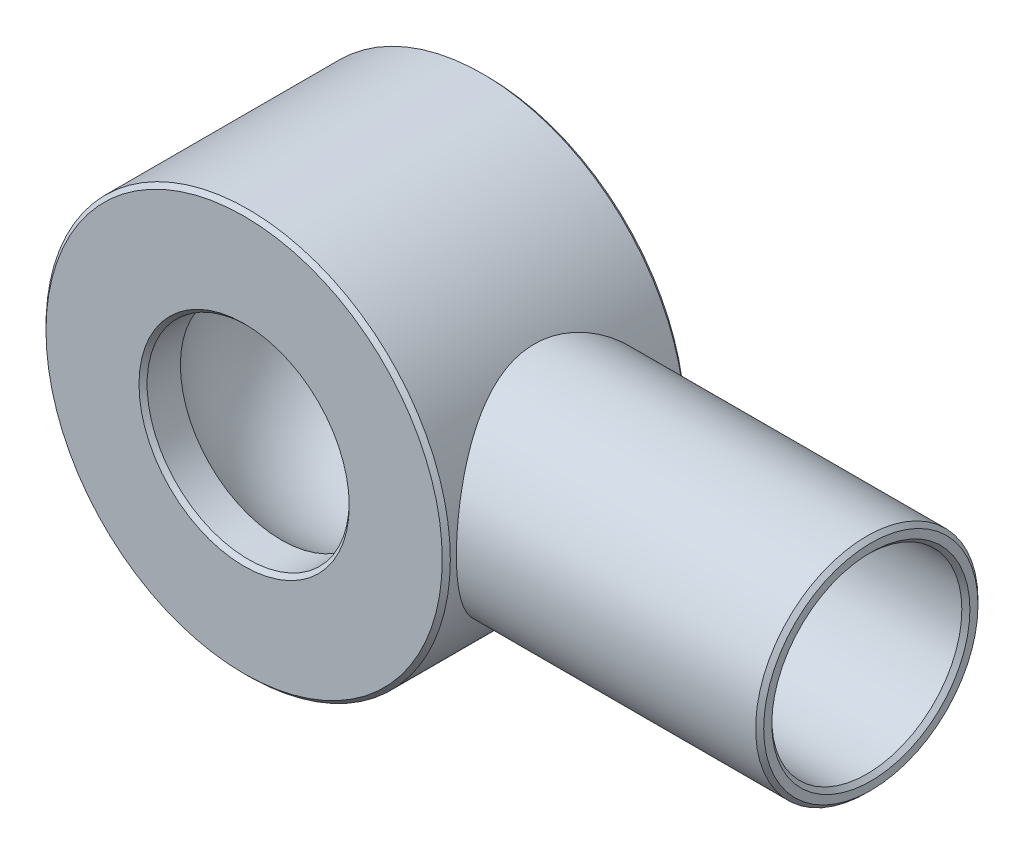
ISO-10303-21;
HEADER;
FILE_DESCRIPTION(('STEP AP214'),'2;1');
FILE_NAME('part.step','',(''),(''),'','','');
FILE_SCHEMA(('AUTOMOTIVE_DESIGN { 1 0 10303 214 1 1 1 1 }'));
ENDSEC;
DATA;
#1=APPLICATION_CONTEXT('core data for automotive mechanical design processes');
#2=APPLICATION_PROTOCOL_DEFINITION('international standard','automotive_design',2000,#1);
#3=PRODUCT_CONTEXT('',#1,'mechanical');
#4=PRODUCT('Part','Part','',(#3));
#5=PRODUCT_RELATED_PRODUCT_CATEGORY('part','',(#4));
#6=PRODUCT_DEFINITION_FORMATION('','',#4);
#7=PRODUCT_DEFINITION_CONTEXT('part definition',#1,'design');
#8=PRODUCT_DEFINITION('design','',#6,#7);
#9=PRODUCT_DEFINITION_SHAPE('','',#8);
#10=(LENGTH_UNIT() NAMED_UNIT(*) SI_UNIT(.MILLI.,.METRE.));
#11=(NAMED_UNIT(*) PLANE_ANGLE_UNIT() SI_UNIT($,.RADIAN.));
#12=(NAMED_UNIT(*) SI_UNIT($,.STERADIAN.) SOLID_ANGLE_UNIT());
#13=UNCERTAINTY_MEASURE_WITH_UNIT(LENGTH_MEASURE(1.E-05),#10,'distance_accuracy_value','');
#14=(GEOMETRIC_REPRESENTATION_CONTEXT(3) GLOBAL_UNCERTAINTY_ASSIGNED_CONTEXT((#13)) GLOBAL_UNIT_ASSIGNED_CONTEXT((#10,
#11,#12)) REPRESENTATION_CONTEXT('',''));
#15=CARTESIAN_POINT('',(0.,0.,0.));
#16=DIRECTION('',(0.,0.,1.));
#17=DIRECTION('',(1.,0.,0.));
#18=AXIS2_PLACEMENT_3D('',#15,#16,#17);
#19=CARTESIAN_POINT('',(0.,0.,-30.));
#20=DIRECTION('',(0.,0.,1.));
#21=DIRECTION('',(1.,0.,0.));
#22=AXIS2_PLACEMENT_3D('',#19,#20,#21);
#23=CYLINDRICAL_SURFACE('',#22,25.);
#24=CARTESIAN_POINT('',(0.,0.,29.));
#25=DIRECTION('',(0.,0.,1.));
#26=DIRECTION('',(1.,0.,0.));
#27=AXIS2_PLACEMENT_3D('',#24,#25,#26);
#28=CIRCLE('',#27,25.);
#29=CARTESIAN_POINT('',(25.,0.,29.));
#30=VERTEX_POINT('',#29);
#31=EDGE_CURVE('E59',#30,#30,#28,.T.);
#32=ORIENTED_EDGE('',*,*,#31,.T.);
#33=EDGE_LOOP('',(#32));
#34=FACE_BOUND('',#33,.T.);
#35=CARTESIAN_POINT('',(0.,0.,20.7665596572952));
#36=DIRECTION('',(0.,0.,-1.));
#37=DIRECTION('',(-1.,0.,0.));
#38=AXIS2_PLACEMENT_3D('',#35,#36,#37);
#39=CIRCLE('',#38,25.);
#40=CARTESIAN_POINT('',(-25.,0.,20.7665596572952));
#41=VERTEX_POINT('',#40);
#42=EDGE_CURVE('E88',#41,#41,#39,.F.);
#43=ORIENTED_EDGE('',*,*,#42,.F.);
#44=EDGE_LOOP('',(#43));
#45=FACE_BOUND('',#44,.T.);
#46=ADVANCED_FACE('F36',(#34,#45),#23,.F.);
#47=CARTESIAN_POINT('',(0.,0.,-29.));
#48=DIRECTION('',(0.,0.,1.));
#49=DIRECTION('',(1.,0.,0.));
#50=AXIS2_PLACEMENT_3D('',#47,#48,#49);
#51=CIRCLE('',#50,25.);
#52=CARTESIAN_POINT('',(25.,0.,-29.));
#53=VERTEX_POINT('',#52);
#54=EDGE_CURVE('E68',#53,#53,#51,.F.);
#55=ORIENTED_EDGE('',*,*,#54,.T.);
#56=EDGE_LOOP('',(#55));
#57=FACE_BOUND('',#56,.T.);
#58=CARTESIAN_POINT('',(0.,0.,-20.7665596572952));
#59=DIRECTION('',(0.,0.,1.));
#60=DIRECTION('',(1.,0.,0.));
#61=AXIS2_PLACEMENT_3D('',#58,#59,#60);
#62=CIRCLE('',#61,25.);
#63=CARTESIAN_POINT('',(25.,0.,-20.7665596572952));
#64=VERTEX_POINT('',#63);
#65=EDGE_CURVE('E165',#64,#64,#62,.F.);
#66=ORIENTED_EDGE('',*,*,#65,.F.);
#67=EDGE_LOOP('',(#66));
#68=FACE_BOUND('',#67,.T.);
#69=ADVANCED_FACE('F111',(#57,#68),#23,.F.);
#70=CARTESIAN_POINT('',(0.,0.,-30.));
#71=DIRECTION('',(0.,0.,1.));
#72=DIRECTION('',(1.,0.,0.));
#73=AXIS2_PLACEMENT_3D('',#70,#71,#72);
#74=CYLINDRICAL_SURFACE('',#73,50.);
#75=CARTESIAN_POINT('',(0.,0.,29.));
#76=DIRECTION('',(0.,0.,1.));
#77=DIRECTION('',(1.,0.,0.));
#78=AXIS2_PLACEMENT_3D('',#75,#76,#77);
#79=CIRCLE('',#78,50.);
#80=CARTESIAN_POINT('',(50.,0.,29.));
#81=VERTEX_POINT('',#80);
#82=EDGE_CURVE('E62',#81,#81,#79,.F.);
#83=ORIENTED_EDGE('',*,*,#82,.T.);
#84=EDGE_LOOP('',(#83));
#85=FACE_BOUND('',#84,.T.);
#86=CARTESIAN_POINT('',(0.,0.,-29.));
#87=DIRECTION('',(0.,0.,1.));
#88=DIRECTION('',(1.,0.,0.));
#89=AXIS2_PLACEMENT_3D('',#86,#87,#88);
#90=CIRCLE('',#89,50.);
#91=CARTESIAN_POINT('',(50.,0.,-29.));
#92=VERTEX_POINT('',#91);
#93=EDGE_CURVE('E77',#92,#92,#90,.T.);
#94=ORIENTED_EDGE('',*,*,#93,.T.);
#95=EDGE_LOOP('',(#94));
#96=FACE_BOUND('',#95,.T.);
#97=CARTESIAN_POINT('',(50.,0.,-27.5));
#98=CARTESIAN_POINT('',(49.9999941228899,0.71406770302452,-27.4999933285147));
#99=CARTESIAN_POINT('',(49.9846643083219,1.42829199877779,-27.47214748126));
#100=CARTESIAN_POINT('',(49.9237219112158,2.85123638903735,-27.3611055405336));
#101=CARTESIAN_POINT('',(49.8781003975093,3.55995479782781,-27.2778931228333));
#102=CARTESIAN_POINT('',(49.7576732247813,4.96721444374425,-27.0570623416612));
#103=CARTESIAN_POINT('',(49.6828328437855,5.66574254297688,-26.9193792458501));
#104=CARTESIAN_POINT('',(49.5058467782831,7.04668581753309,-26.5913128181861));
#105=CARTESIAN_POINT('',(49.4037028021032,7.72910199803828,-26.4009327834403));
#106=CARTESIAN_POINT('',(49.1750428705722,9.07062743924555,-25.970520310243));
#107=CARTESIAN_POINT('',(49.0486302867225,9.72982199831722,-25.7306981600428));
#108=CARTESIAN_POINT('',(48.7740390388397,11.0241021131546,-25.2033242020003));
#109=CARTESIAN_POINT('',(48.625860109854,11.6591873753296,-24.9157718131525));
#110=CARTESIAN_POINT('',(48.3109651695803,12.9019995835491,-24.2954880281582));
#111=CARTESIAN_POINT('',(48.1442506007647,13.5097286533314,-23.9627601471939));
#112=CARTESIAN_POINT('',(47.7957333284469,14.6952262955576,-23.2546150057814));
#113=CARTESIAN_POINT('',(47.6139300002468,15.2729936259289,-22.8791959776159));
#114=CARTESIAN_POINT('',(47.2259743911305,16.4349578990261,-22.0608534518093));
#115=CARTESIAN_POINT('',(47.0190074411819,17.0168641613757,-21.6150630584524));
#116=CARTESIAN_POINT('',(46.5966374370901,18.1415065919816,-20.6801963210012));
#117=CARTESIAN_POINT('',(46.381234072101,18.6842413148345,-20.1911183811066));
#118=CARTESIAN_POINT('',(45.9466298448405,19.7288494846544,-19.1717379127614));
#119=CARTESIAN_POINT('',(45.7274258772382,20.2306874042049,-18.6414003070781));
#120=CARTESIAN_POINT('',(45.2904336086245,21.1909163143986,-17.5421697957343));
#121=CARTESIAN_POINT('',(45.0726453871494,21.6493048833831,-16.9732747440935));
#122=CARTESIAN_POINT('',(44.6225721383367,22.5634788177301,-15.7411708776258));
#123=CARTESIAN_POINT('',(44.3909773420459,23.0145435956634,-15.0741949405774));
#124=CARTESIAN_POINT('',(43.9431511929515,23.8584948804979,-13.699373903289));
#125=CARTESIAN_POINT('',(43.72692117049,24.2513763528468,-12.9915252737262));
#126=CARTESIAN_POINT('',(43.3175641655769,24.9752178065191,-11.5389135279519));
#127=CARTESIAN_POINT('',(43.1244236150102,25.3062142186292,-10.7941724584935));
#128=CARTESIAN_POINT('',(42.7687915179005,25.9027263494772,-9.27182878640479));
#129=CARTESIAN_POINT('',(42.606295932131,26.168250699324,-8.49423053114926));
#130=CARTESIAN_POINT('',(42.328290947687,26.6154232220592,-6.96172199694451));
#131=CARTESIAN_POINT('',(42.210465914982,26.8013025822984,-6.20846993904671));
#132=CARTESIAN_POINT('',(42.0133223299797,27.1093039228541,-4.68402776670712));
#133=CARTESIAN_POINT('',(41.9340017691561,27.2314292288276,-3.91283859012701));
#134=CARTESIAN_POINT('',(41.8177525353831,27.4096144170769,-2.36062538472185));
#135=CARTESIAN_POINT('',(41.7807718582962,27.4657553471931,-1.57961461452598));
#136=CARTESIAN_POINT('',(41.750912736357,27.5111276923674,-0.0148543615743457));
#137=CARTESIAN_POINT('',(41.7580282583742,27.5003682605633,0.768894731866845));
#138=CARTESIAN_POINT('',(41.811525905211,27.4189343812309,2.21175930465638));
#139=CARTESIAN_POINT('',(41.8517570024226,27.3576432175325,2.8716615477635));
#140=CARTESIAN_POINT('',(41.9621156730449,27.1880692367846,4.18278760694618));
#141=CARTESIAN_POINT('',(42.0322396172107,27.0797921241986,4.83401246663488));
#142=CARTESIAN_POINT('',(42.2000202091037,26.8175770554436,6.12379733488574));
#143=CARTESIAN_POINT('',(42.2976872830174,26.6636218071046,6.76235244927332));
#144=CARTESIAN_POINT('',(42.5174338806646,26.3117991162985,8.02293679364123));
#145=CARTESIAN_POINT('',(42.6395149309385,26.1139289278632,8.64496498748107));
#146=CARTESIAN_POINT('',(42.9073628056848,25.6715105031569,9.88254045575717));
#147=CARTESIAN_POINT('',(43.0535802944461,25.4260546005015,10.4976647176735));
#148=CARTESIAN_POINT('',(43.3637537096539,24.8933689221034,11.7049391019034));
#149=CARTESIAN_POINT('',(43.5277114403284,24.6061348963944,12.2970868791139));
#150=CARTESIAN_POINT('',(43.8693200020082,23.9917960819308,13.4563809394496));
#151=CARTESIAN_POINT('',(44.0469743154648,23.6646811408044,14.0235208061386));
#152=CARTESIAN_POINT('',(44.4119331933946,22.9724465831665,15.1308668167912));
#153=CARTESIAN_POINT('',(44.5992384949738,22.6073240616008,15.6710708972829));
#154=CARTESIAN_POINT('',(45.0096508687935,21.7801909233222,16.805983492969));
#155=CARTESIAN_POINT('',(45.2337416567359,21.3119845965813,17.395832595982));
#156=CARTESIAN_POINT('',(45.6838628389132,20.3292112649516,18.534806241012));
#157=CARTESIAN_POINT('',(45.909893400387,19.8146402256181,19.083927231461));
#158=CARTESIAN_POINT('',(46.3585037481119,18.7410712543418,20.1392433752547));
#159=CARTESIAN_POINT('',(46.5810811791114,18.1820444666578,20.645410199642));
#160=CARTESIAN_POINT('',(47.0173190939814,17.0222090593046,21.6116665293551));
#161=CARTESIAN_POINT('',(47.230979416562,16.4213996844084,22.0717552014439));
#162=CARTESIAN_POINT('',(47.6581911792684,15.1388160675107,22.9721718862497));
#163=CARTESIAN_POINT('',(47.8707687660966,14.4543141348947,23.4090895390183));
#164=CARTESIAN_POINT('',(48.2740347760998,13.0443540478441,24.2230765692946));
#165=CARTESIAN_POINT('',(48.4647217957988,12.3188932718471,24.6001421100798));
#166=CARTESIAN_POINT('',(48.8185085796566,10.8321993198402,25.2900063393272));
#167=CARTESIAN_POINT('',(48.9816289356111,10.0709933928341,25.6028530359314));
#168=CARTESIAN_POINT('',(49.2754248095309,8.51801920667006,26.1605376050559));
#169=CARTESIAN_POINT('',(49.4061049427221,7.72625531349304,26.4053851523111));
#170=CARTESIAN_POINT('',(49.620336770862,6.19385657293278,26.8039791012411));
#171=CARTESIAN_POINT('',(49.7071442675213,5.45532781383963,26.9640864306742));
#172=CARTESIAN_POINT('',(49.848196293985,3.96455359237953,27.2232352812455));
#173=CARTESIAN_POINT('',(49.9024427819128,3.21230895764889,27.3222804744908));
#174=CARTESIAN_POINT('',(49.9767847644558,1.70092879108316,27.4578262708961));
#175=CARTESIAN_POINT('',(49.9968985075515,0.941797159660144,27.4943602946562));
#176=CARTESIAN_POINT('',(50.0024360650784,-0.576988923593905,27.5044298280809));
#177=CARTESIAN_POINT('',(49.9878621240914,-1.33664333841659,27.4779694140099));
#178=CARTESIAN_POINT('',(49.9275772207974,-2.77558379601958,27.36813403945));
#179=CARTESIAN_POINT('',(49.8850535458149,-3.45545849027006,27.290583324023));
#180=CARTESIAN_POINT('',(49.7731592261156,-4.80533003848318,27.0855085996627));
#181=CARTESIAN_POINT('',(49.7037907633305,-5.47532769065391,26.9579886521947));
#182=CARTESIAN_POINT('',(49.5397973125825,-6.80108163566171,26.6544145219836));
#183=CARTESIAN_POINT('',(49.4451710675899,-7.45683721794235,26.4783579236535));
#184=CARTESIAN_POINT('',(49.2327596914995,-8.7501360069042,26.0795531734745));
#185=CARTESIAN_POINT('',(49.1149735470447,-9.38767841527297,25.8568029785278));
#186=CARTESIAN_POINT('',(48.855874704731,-10.6551033095298,25.3612322139169));
#187=CARTESIAN_POINT('',(48.7140943917375,-11.2844948739943,25.087402448526));
#188=CARTESIAN_POINT('',(48.4119438771444,-12.5174523193036,24.4955312061907));
#189=CARTESIAN_POINT('',(48.2515736173644,-13.1210181193142,24.1774895908771));
#190=CARTESIAN_POINT('',(47.915457766297,-14.2998147461542,23.4995271473097));
#191=CARTESIAN_POINT('',(47.7397085270724,-14.8750387993891,23.1395963761125));
#192=CARTESIAN_POINT('',(47.3762634625092,-15.9948797699199,22.3801589782511));
#193=CARTESIAN_POINT('',(47.1885665605746,-16.5394939206278,21.9806487833009));
#194=CARTESIAN_POINT('',(46.8900437183499,-17.3614967891339,21.3299986310059));
#195=CARTESIAN_POINT('',(46.7820754256454,-17.6502029797307,21.091709189964));
#196=CARTESIAN_POINT('',(46.5642218600573,-18.2171747199677,20.6039886331149));
#197=CARTESIAN_POINT('',(46.4543370001703,-18.495442479218,20.3545599000443));
#198=CARTESIAN_POINT('',(46.1227041696778,-19.3143180352313,19.5899192954647));
#199=CARTESIAN_POINT('',(45.8989730841416,-19.8390113717298,19.058342512337));
#200=CARTESIAN_POINT('',(45.451441715998,-20.8439299723355,17.9537944753547));
#201=CARTESIAN_POINT('',(45.2276415830193,-21.3241108384559,17.3807828857878));
#202=CARTESIAN_POINT('',(44.7857442185434,-22.2372295511987,16.1961381084623));
#203=CARTESIAN_POINT('',(44.5676472097339,-22.6701655551575,15.584503415777));
#204=CARTESIAN_POINT('',(44.1264619219851,-23.5181045235939,14.2759573397123));
#205=CARTESIAN_POINT('',(43.9043077567529,-23.9290849454712,13.5761143560198));
#206=CARTESIAN_POINT('',(43.4810447361898,-24.6898431557276,12.1376918632391));
#207=CARTESIAN_POINT('',(43.2799375116146,-25.0396162030556,11.3991093591874));
#208=CARTESIAN_POINT('',(42.9067995311649,-25.6737583424579,9.88829638694173));
#209=CARTESIAN_POINT('',(42.7347343040884,-25.9582051198878,9.11610719765023));
#210=CARTESIAN_POINT('',(42.4269720348725,-26.4582405195642,7.5427110876919));
#211=CARTESIAN_POINT('',(42.2912681918379,-26.6738420198179,6.74150962523671));
#212=CARTESIAN_POINT('',(42.0739611671987,-27.0151559365139,5.19574202509264));
#213=CARTESIAN_POINT('',(41.9883902895037,-27.1475534093435,4.45320929092752));
#214=CARTESIAN_POINT('',(41.8561171191562,-27.3510573759031,2.95634012243282));
#215=CARTESIAN_POINT('',(41.8094119424581,-27.4221684174323,2.20200456816933));
#216=CARTESIAN_POINT('',(41.757081578,-27.5017895668766,0.689161216730129));
#217=CARTESIAN_POINT('',(41.7514263758776,-27.5103454130824,-0.0693431261817747));
#218=CARTESIAN_POINT('',(41.7813950213236,-27.464810334016,-1.58360896091266));
#219=CARTESIAN_POINT('',(41.8170154653574,-27.4107245740872,-2.33937067373073));
#220=CARTESIAN_POINT('',(41.9202510243075,-27.2525215946292,-3.7384614362644));
#221=CARTESIAN_POINT('',(41.9828416743356,-27.1562313182031,-4.38307060801088));
#222=CARTESIAN_POINT('',(42.1353835624559,-26.9189402767088,-5.66062477750287));
#223=CARTESIAN_POINT('',(42.2253316858041,-26.777944601429,-6.29357109440901));
#224=CARTESIAN_POINT('',(42.4297868734207,-26.4527880789437,-7.54438751251577));
#225=CARTESIAN_POINT('',(42.5443017597785,-26.2686134817752,-8.1622527419274));
#226=CARTESIAN_POINT('',(42.7945527719963,-25.8589215377159,-9.37969962381614));
#227=CARTESIAN_POINT('',(42.930290469422,-25.6334011289218,-9.97927991834705));
#228=CARTESIAN_POINT('',(43.2282409382338,-25.1278810000802,-11.1936688665594));
#229=CARTESIAN_POINT('',(43.3915648452982,-24.8453938393459,-11.8071681690586));
#230=CARTESIAN_POINT('',(43.7336966009333,-24.2380944019975,-13.0083749860081));
#231=CARTESIAN_POINT('',(43.9125060961716,-23.9132776223847,-13.5960797475467));
#232=CARTESIAN_POINT('',(44.2813253916305,-23.2232059921965,-14.7438551950195));
#233=CARTESIAN_POINT('',(44.4713392956247,-22.8579362816046,-15.3039156161094));
#234=CARTESIAN_POINT('',(44.8582990422471,-22.0888735543613,-16.3944169201372));
#235=CARTESIAN_POINT('',(45.0552453752574,-21.6850778090085,-16.9248557008249));
#236=CARTESIAN_POINT('',(45.4831723143569,-20.7743175840222,-18.0352738282508));
#237=CARTESIAN_POINT('',(45.7146422110803,-20.2611084007596,-18.6099581097177));
#238=CARTESIAN_POINT('',(46.175421469004,-19.1877977549036,-19.714757194301));
#239=CARTESIAN_POINT('',(46.4047306167579,-18.627691712597,-20.2448676344034));
#240=CARTESIAN_POINT('',(46.8555901866432,-17.4626472131006,-21.257992947195));
#241=CARTESIAN_POINT('',(47.0771347587262,-16.8576759789028,-21.7409727792641));
#242=CARTESIAN_POINT('',(47.5067427183123,-15.6059978953014,-22.6562104488661));
#243=CARTESIAN_POINT('',(47.7148065070409,-14.9592922891729,-23.088469796292));
#244=CARTESIAN_POINT('',(48.1191132606485,-13.603977882041,-23.9130230799662));
#245=CARTESIAN_POINT('',(48.3146893912409,-12.8939958046374,-24.3033934276246));
#246=CARTESIAN_POINT('',(48.680216750193,-11.4368114688612,-25.0221761828152));
#247=CARTESIAN_POINT('',(48.8501645148373,-10.6896041975658,-25.3505802170035));
#248=CARTESIAN_POINT('',(49.158980529803,-9.16505496429457,-25.9406715971658));
#249=CARTESIAN_POINT('',(49.2979175528384,-8.38778426131023,-26.2025067564997));
#250=CARTESIAN_POINT('',(49.5407693969119,-6.80806921659794,-26.6566082360642));
#251=CARTESIAN_POINT('',(49.6447025469894,-6.00563829086714,-26.8489109693771));
#252=CARTESIAN_POINT('',(49.7739717963267,-4.76822030833763,-27.0869492410809));
#253=CARTESIAN_POINT('',(49.8132021125099,-4.33953900075517,-27.1589347855096));
#254=CARTESIAN_POINT('',(49.8807223008421,-3.47848089987598,-27.2825803009383));
#255=CARTESIAN_POINT('',(49.9090152213332,-3.04610517063265,-27.3342459353339));
#256=CARTESIAN_POINT('',(49.9543951175279,-2.17876569279235,-27.4170163740584));
#257=CARTESIAN_POINT('',(49.9714810908657,-1.74380171620861,-27.4481193392335));
#258=CARTESIAN_POINT('',(49.9942858341488,-0.872578056245374,-27.4896141132902));
#259=CARTESIAN_POINT('',(50.0000035911027,-0.43631826086743,-27.5000040764914));
#260=CARTESIAN_POINT('',(50.,0.,-27.5));
#261=B_SPLINE_CURVE_WITH_KNOTS('',3,(#97,#98,#99,#100,#101,#102,#103,#104,#105,#106,#107,#108,
#109,#110,#111,#112,#113,#114,#115,#116,#117,#118,#119,#120,#121,#122,#123,#124,#125,#126,#127,
#128,#129,#130,#131,#132,#133,#134,#135,#136,#137,#138,#139,#140,#141,#142,#143,#144,#145,#146,
#147,#148,#149,#150,#151,#152,#153,#154,#155,#156,#157,#158,#159,#160,#161,#162,#163,#164,#165,
#166,#167,#168,#169,#170,#171,#172,#173,#174,#175,#176,#177,#178,#179,#180,#181,#182,#183,#184,
#185,#186,#187,#188,#189,#190,#191,#192,#193,#194,#195,#196,#197,#198,#199,#200,#201,#202,#203,
#204,#205,#206,#207,#208,#209,#210,#211,#212,#213,#214,#215,#216,#217,#218,#219,#220,#221,#222,
#223,#224,#225,#226,#227,#228,#229,#230,#231,#232,#233,#234,#235,#236,#237,#238,#239,#240,#241,
#242,#243,#244,#245,#246,#247,#248,#249,#250,#251,#252,#253,#254,#255,#256,#257,#258,#259,#260),
.UNSPECIFIED.,.T.,.F.,(4,2,2,2,2,2,2,2,2,2,2,2,2,2,2,2,2,2,2,2,2,2,2,2,2,2,2,2,2,2,2,2,2,2,2,2,
2,2,2,2,2,2,2,2,2,2,2,2,2,2,2,2,2,2,2,2,2,2,2,2,2,2,2,2,2,2,2,2,2,2,2,2,2,2,2,2,2,2,2,2,2,4),
(0.,2.14177250400644,4.28417676623598,6.42913472239616,8.57395850458249,10.7098414177083,
12.8457503321896,14.9814931431006,17.1173244211933,19.4000485812189,21.68285692921,
23.9676276901658,26.2525257185167,28.7628983065354,31.2734879882192,33.7825950384192,
36.2913711387861,38.6420518309079,40.9926098902203,43.3402777591482,45.6876244331761,
47.6771485761245,49.6664312427556,51.6564679462991,53.6466291204146,55.6793470777504,
57.7122719623468,59.7457154477272,61.7793144706884,64.1339674972552,66.4888256131639,
68.8452249173368,71.2016668248789,73.7165989562271,76.2316922381752,78.7448984064795,
81.2577468192144,83.5365576933213,85.8152315127041,88.0926866943573,90.3699945097139,
92.4244014381953,94.4786414204947,96.5329836572991,98.5874158014714,100.687835788653,
102.788262349636,104.889188495309,106.9903042228,108.158839630326,109.327126269844,
111.663646883685,114.002473482108,116.341391267838,118.862464879394,121.383733683994,
123.901988513627,126.419772009146,128.69362320105,130.967305645823,133.239325482755,
135.511157985294,137.47323917975,139.435097067972,141.397580543875,143.360209412096,
145.442803746533,147.525619807198,149.609203525224,151.692934927921,154.103779191143,
156.514859160589,158.927718273886,161.340505540795,163.837578173554,166.334987987861,
168.826803000234,171.317311190225,172.626134289628,173.934592345837,175.24316741652,
176.55185908562),.UNSPECIFIED.);
#262=CARTESIAN_POINT('',(50.,0.,-27.5));
#263=VERTEX_POINT('',#262);
#264=EDGE_CURVE('E80',#263,#263,#261,.T.);
#265=ORIENTED_EDGE('',*,*,#264,.F.);
#266=EDGE_LOOP('',(#265));
#267=FACE_BOUND('',#266,.T.);
#268=ADVANCED_FACE('F90',(#85,#96,#267),#74,.T.);
#269=CARTESIAN_POINT('',(0.,0.,-30.));
#270=DIRECTION('',(0.,0.,1.));
#271=DIRECTION('',(1.,0.,0.));
#272=AXIS2_PLACEMENT_3D('',#269,#270,#271);
#273=PLANE('',#272);
#274=CARTESIAN_POINT('',(0.,0.,-30.));
#275=DIRECTION('',(0.,0.,1.));
#276=DIRECTION('',(1.,0.,0.));
#277=AXIS2_PLACEMENT_3D('',#274,#275,#276);
#278=CIRCLE('',#277,26.);
#279=CARTESIAN_POINT('',(26.,0.,-30.));
#280=VERTEX_POINT('',#279);
#281=EDGE_CURVE('E71',#280,#280,#278,.T.);
#282=ORIENTED_EDGE('',*,*,#281,.T.);
#283=EDGE_LOOP('',(#282));
#284=FACE_BOUND('',#283,.T.);
#285=CARTESIAN_POINT('',(0.,0.,-30.));
#286=DIRECTION('',(0.,0.,1.));
#287=DIRECTION('',(1.,0.,0.));
#288=AXIS2_PLACEMENT_3D('',#285,#286,#287);
#289=CIRCLE('',#288,49.);
#290=CARTESIAN_POINT('',(49.,0.,-30.));
#291=VERTEX_POINT('',#290);
#292=EDGE_CURVE('E74',#291,#291,#289,.F.);
#293=ORIENTED_EDGE('',*,*,#292,.T.);
#294=EDGE_LOOP('',(#293));
#295=FACE_BOUND('',#294,.T.);
#296=ADVANCED_FACE('F108',(#284,#295),#273,.F.);
#297=CARTESIAN_POINT('',(0.,0.,30.));
#298=DIRECTION('',(0.,0.,1.));
#299=DIRECTION('',(1.,0.,0.));
#300=AXIS2_PLACEMENT_3D('',#297,#298,#299);
#301=PLANE('',#300);
#302=CARTESIAN_POINT('',(0.,0.,30.));
#303=DIRECTION('',(0.,0.,1.));
#304=DIRECTION('',(1.,0.,0.));
#305=AXIS2_PLACEMENT_3D('',#302,#303,#304);
#306=CIRCLE('',#305,26.);
#307=CARTESIAN_POINT('',(26.,0.,30.));
#308=VERTEX_POINT('',#307);
#309=EDGE_CURVE('E56',#308,#308,#306,.F.);
#310=ORIENTED_EDGE('',*,*,#309,.T.);
#311=EDGE_LOOP('',(#310));
#312=FACE_BOUND('',#311,.T.);
#313=CARTESIAN_POINT('',(0.,0.,30.));
#314=DIRECTION('',(0.,0.,1.));
#315=DIRECTION('',(1.,0.,0.));
#316=AXIS2_PLACEMENT_3D('',#313,#314,#315);
#317=CIRCLE('',#316,49.);
#318=CARTESIAN_POINT('',(49.,0.,30.));
#319=VERTEX_POINT('',#318);
#320=EDGE_CURVE('E65',#319,#319,#317,.T.);
#321=ORIENTED_EDGE('',*,*,#320,.T.);
#322=EDGE_LOOP('',(#321));
#323=FACE_BOUND('',#322,.T.);
#324=ADVANCED_FACE('F104',(#312,#323),#301,.T.);
#325=CARTESIAN_POINT('',(0.,0.,0.));
#326=DIRECTION('',(0.,1.,0.));
#327=DIRECTION('',(0.,0.,-1.));
#328=AXIS2_PLACEMENT_3D('',#325,#326,#327);
#329=SPHERICAL_SURFACE('',#328,32.5);
#330=CARTESIAN_POINT('',(0.,0.,0.));
#331=DIRECTION('',(0.,0.,1.));
#332=DIRECTION('',(1.,0.,0.));
#333=AXIS2_PLACEMENT_3D('',#330,#331,#332);
#334=SPHERICAL_SURFACE('',#333,32.5);
#335=ORIENTED_EDGE('',*,*,#65,.T.);
#336=EDGE_LOOP('',(#335));
#337=FACE_BOUND('',#336,.T.);
#338=ORIENTED_EDGE('',*,*,#42,.T.);
#339=EDGE_LOOP('',(#338));
#340=FACE_BOUND('',#339,.T.);
#341=ADVANCED_FACE('F100',(#337,#340),#334,.F.);
#342=CARTESIAN_POINT('',(35.,0.,0.));
#343=DIRECTION('',(1.,0.,0.));
#344=DIRECTION('',(0.,0.,-1.));
#345=AXIS2_PLACEMENT_3D('',#342,#343,#344);
#346=CYLINDRICAL_SURFACE('',#345,27.5);
#347=CARTESIAN_POINT('',(124.,0.,0.));
#348=DIRECTION('',(1.,0.,0.));
#349=DIRECTION('',(0.,0.,-1.));
#350=AXIS2_PLACEMENT_3D('',#347,#348,#349);
#351=CIRCLE('',#350,27.5);
#352=CARTESIAN_POINT('',(124.,0.,-27.5));
#353=VERTEX_POINT('',#352);
#354=EDGE_CURVE('E10',#353,#353,#351,.F.);
#355=ORIENTED_EDGE('',*,*,#354,.T.);
#356=EDGE_LOOP('',(#355));
#357=FACE_BOUND('',#356,.T.);
#358=ORIENTED_EDGE('',*,*,#264,.T.);
#359=EDGE_LOOP('',(#358));
#360=FACE_BOUND('',#359,.T.);
#361=ADVANCED_FACE('F94',(#357,#360),#346,.T.);
#362=CARTESIAN_POINT('',(125.,0.,0.));
#363=DIRECTION('',(1.,0.,0.));
#364=DIRECTION('',(0.,0.,-1.));
#365=AXIS2_PLACEMENT_3D('',#362,#363,#364);
#366=PLANE('',#365);
#367=CARTESIAN_POINT('',(125.,0.,0.));
#368=DIRECTION('',(1.,0.,0.));
#369=DIRECTION('',(0.,0.,-1.));
#370=AXIS2_PLACEMENT_3D('',#367,#368,#369);
#371=CIRCLE('',#370,24.5);
#372=CARTESIAN_POINT('',(125.,0.,-24.5));
#373=VERTEX_POINT('',#372);
#374=EDGE_CURVE('E43',#373,#373,#371,.F.);
#375=ORIENTED_EDGE('',*,*,#374,.T.);
#376=EDGE_LOOP('',(#375));
#377=FACE_BOUND('',#376,.T.);
#378=CARTESIAN_POINT('',(125.,0.,0.));
#379=DIRECTION('',(1.,0.,0.));
#380=DIRECTION('',(0.,0.,-1.));
#381=AXIS2_PLACEMENT_3D('',#378,#379,#380);
#382=CIRCLE('',#381,26.5000000000001);
#383=CARTESIAN_POINT('',(125.,0.,-26.5000000000001));
#384=VERTEX_POINT('',#383);
#385=EDGE_CURVE('E47',#384,#384,#382,.T.);
#386=ORIENTED_EDGE('',*,*,#385,.T.);
#387=EDGE_LOOP('',(#386));
#388=FACE_BOUND('',#387,.T.);
#389=ADVANCED_FACE('F99',(#377,#388),#366,.T.);
#390=CARTESIAN_POINT('',(90.,0.,0.));
#391=DIRECTION('',(1.,0.,0.));
#392=DIRECTION('',(0.,0.,-1.));
#393=AXIS2_PLACEMENT_3D('',#390,#391,#392);
#394=CYLINDRICAL_SURFACE('',#393,23.5);
#395=CARTESIAN_POINT('',(124.,0.,0.));
#396=DIRECTION('',(1.,0.,0.));
#397=DIRECTION('',(0.,0.,-1.));
#398=AXIS2_PLACEMENT_3D('',#395,#396,#397);
#399=CIRCLE('',#398,23.5);
#400=CARTESIAN_POINT('',(124.,0.,-23.5));
#401=VERTEX_POINT('',#400);
#402=EDGE_CURVE('E51',#401,#401,#399,.T.);
#403=ORIENTED_EDGE('',*,*,#402,.T.);
#404=EDGE_LOOP('',(#403));
#405=FACE_BOUND('',#404,.T.);
#406=CARTESIAN_POINT('',(90.,0.,0.));
#407=DIRECTION('',(1.,0.,0.));
#408=DIRECTION('',(0.,0.,-1.));
#409=AXIS2_PLACEMENT_3D('',#406,#407,#408);
#410=CIRCLE('',#409,23.5);
#411=CARTESIAN_POINT('',(90.,0.,-23.5));
#412=VERTEX_POINT('',#411);
#413=EDGE_CURVE('E164',#412,#412,#410,.T.);
#414=ORIENTED_EDGE('',*,*,#413,.F.);
#415=EDGE_LOOP('',(#414));
#416=FACE_BOUND('',#415,.T.);
#417=ADVANCED_FACE('F140',(#405,#416),#394,.F.);
#418=CARTESIAN_POINT('',(90.,0.,0.));
#419=DIRECTION('',(1.,0.,0.));
#420=DIRECTION('',(0.,0.,-1.));
#421=AXIS2_PLACEMENT_3D('',#418,#419,#420);
#422=PLANE('',#421);
#423=ORIENTED_EDGE('',*,*,#413,.T.);
#424=EDGE_LOOP('',(#423));
#425=FACE_BOUND('',#424,.T.);
#426=ADVANCED_FACE('F127',(#425),#422,.T.);
#427=CARTESIAN_POINT('',(0.,0.,-29.));
#428=DIRECTION('',(0.,0.,1.));
#429=DIRECTION('',(1.,0.,0.));
#430=AXIS2_PLACEMENT_3D('',#427,#428,#429);
#431=CONICAL_SURFACE('',#430,50.,0.785398163397445);
#432=ORIENTED_EDGE('',*,*,#292,.F.);
#433=EDGE_LOOP('',(#432));
#434=FACE_BOUND('',#433,.T.);
#435=ORIENTED_EDGE('',*,*,#93,.F.);
#436=EDGE_LOOP('',(#435));
#437=FACE_BOUND('',#436,.T.);
#438=ADVANCED_FACE('F123',(#434,#437),#431,.T.);
#439=CARTESIAN_POINT('',(0.,0.,-30.));
#440=DIRECTION('',(0.,0.,-1.));
#441=DIRECTION('',(-1.,0.,0.));
#442=AXIS2_PLACEMENT_3D('',#439,#440,#441);
#443=CONICAL_SURFACE('',#442,26.,0.785398163397436);
#444=ORIENTED_EDGE('',*,*,#54,.F.);
#445=EDGE_LOOP('',(#444));
#446=FACE_BOUND('',#445,.T.);
#447=ORIENTED_EDGE('',*,*,#281,.F.);
#448=EDGE_LOOP('',(#447));
#449=FACE_BOUND('',#448,.T.);
#450=ADVANCED_FACE('F126',(#446,#449),#443,.F.);
#451=CARTESIAN_POINT('',(0.,0.,30.));
#452=DIRECTION('',(0.,0.,-1.));
#453=DIRECTION('',(-1.,0.,0.));
#454=AXIS2_PLACEMENT_3D('',#451,#452,#453);
#455=CONICAL_SURFACE('',#454,49.,0.785398163397438);
#456=ORIENTED_EDGE('',*,*,#82,.F.);
#457=EDGE_LOOP('',(#456));
#458=FACE_BOUND('',#457,.T.);
#459=ORIENTED_EDGE('',*,*,#320,.F.);
#460=EDGE_LOOP('',(#459));
#461=FACE_BOUND('',#460,.T.);
#462=ADVANCED_FACE('F137',(#458,#461),#455,.T.);
#463=CARTESIAN_POINT('',(0.,0.,29.));
#464=DIRECTION('',(0.,0.,1.));
#465=DIRECTION('',(1.,0.,0.));
#466=AXIS2_PLACEMENT_3D('',#463,#464,#465);
#467=CONICAL_SURFACE('',#466,25.,0.785398163397445);
#468=ORIENTED_EDGE('',*,*,#309,.F.);
#469=EDGE_LOOP('',(#468));
#470=FACE_BOUND('',#469,.T.);
#471=ORIENTED_EDGE('',*,*,#31,.F.);
#472=EDGE_LOOP('',(#471));
#473=FACE_BOUND('',#472,.T.);
#474=ADVANCED_FACE('F146',(#470,#473),#467,.F.);
#475=CARTESIAN_POINT('',(124.,0.,0.));
#476=DIRECTION('',(1.,0.,0.));
#477=DIRECTION('',(0.,0.,-1.));
#478=AXIS2_PLACEMENT_3D('',#475,#476,#477);
#479=CONICAL_SURFACE('',#478,23.5,0.785398163397448);
#480=ORIENTED_EDGE('',*,*,#374,.F.);
#481=EDGE_LOOP('',(#480));
#482=FACE_BOUND('',#481,.T.);
#483=ORIENTED_EDGE('',*,*,#402,.F.);
#484=EDGE_LOOP('',(#483));
#485=FACE_BOUND('',#484,.T.);
#486=ADVANCED_FACE('F149',(#482,#485),#479,.F.);
#487=CARTESIAN_POINT('',(125.,0.,0.));
#488=DIRECTION('',(-1.,0.,0.));
#489=DIRECTION('',(0.,0.,1.));
#490=AXIS2_PLACEMENT_3D('',#487,#488,#489);
#491=CONICAL_SURFACE('',#490,26.5000000000001,0.785398163397438);
#492=ORIENTED_EDGE('',*,*,#354,.F.);
#493=EDGE_LOOP('',(#492));
#494=FACE_BOUND('',#493,.T.);
#495=ORIENTED_EDGE('',*,*,#385,.F.);
#496=EDGE_LOOP('',(#495));
#497=FACE_BOUND('',#496,.T.);
#498=ADVANCED_FACE('F38',(#494,#497),#491,.T.);
#499=CLOSED_SHELL('',(#46,#69,#268,#296,#324,#341,#361,#389,#417,#426,#438,#450,#462,#474,#486,#498));
#500=MANIFOLD_SOLID_BREP('B2',#499);
#501=ADVANCED_BREP_SHAPE_REPRESENTATION('',(#18,#500),#14);
#502=SHAPE_DEFINITION_REPRESENTATION(#9,#501);
ENDSEC;
END-ISO-10303-21;
